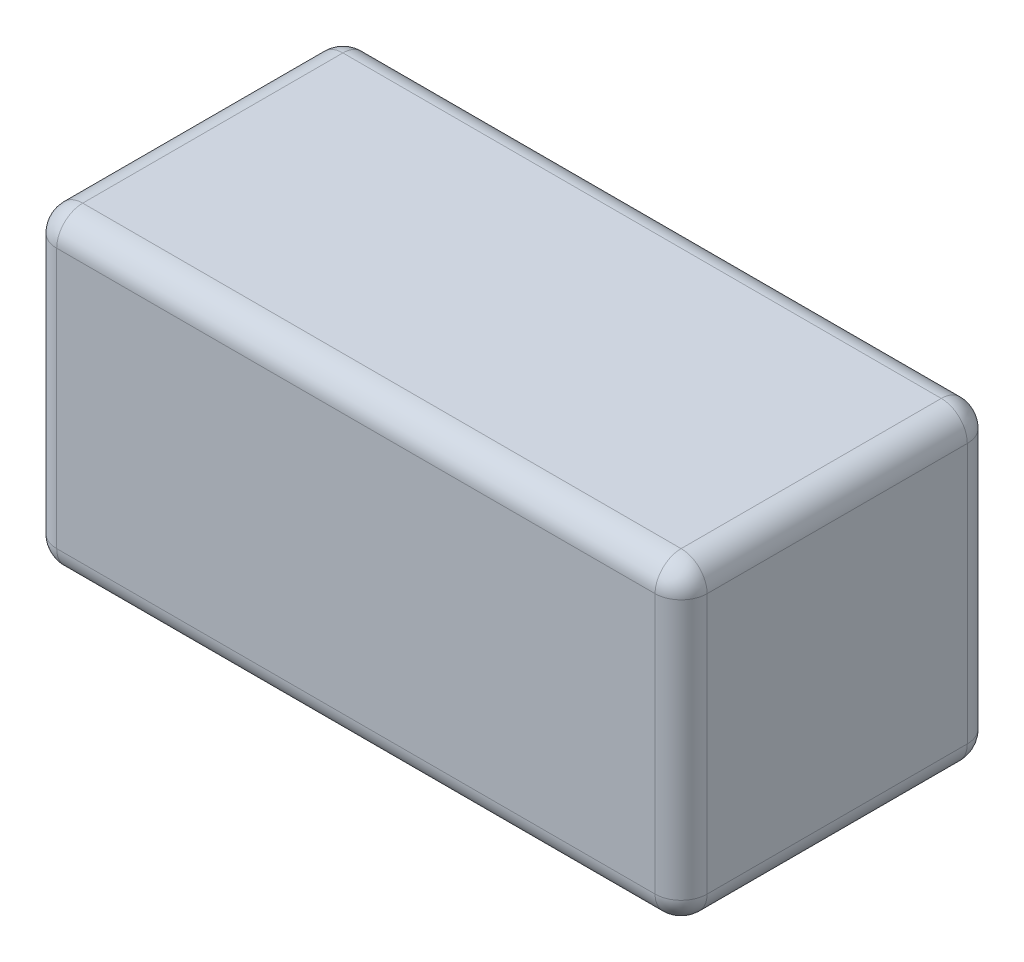
ISO-10303-21;
HEADER;
FILE_DESCRIPTION(('STEP AP214'),'2;1');
FILE_NAME('part.step','',(''),(''),'','','');
FILE_SCHEMA(('AUTOMOTIVE_DESIGN { 1 0 10303 214 1 1 1 1 }'));
ENDSEC;
DATA;
#1=APPLICATION_CONTEXT('core data for automotive mechanical design processes');
#2=APPLICATION_PROTOCOL_DEFINITION('international standard','automotive_design',2000,#1);
#3=PRODUCT_CONTEXT('',#1,'mechanical');
#4=PRODUCT('Part','Part','',(#3));
#5=PRODUCT_RELATED_PRODUCT_CATEGORY('part','',(#4));
#6=PRODUCT_DEFINITION_FORMATION('','',#4);
#7=PRODUCT_DEFINITION_CONTEXT('part definition',#1,'design');
#8=PRODUCT_DEFINITION('design','',#6,#7);
#9=PRODUCT_DEFINITION_SHAPE('','',#8);
#10=(LENGTH_UNIT() NAMED_UNIT(*) SI_UNIT(.MILLI.,.METRE.));
#11=(NAMED_UNIT(*) PLANE_ANGLE_UNIT() SI_UNIT($,.RADIAN.));
#12=(NAMED_UNIT(*) SI_UNIT($,.STERADIAN.) SOLID_ANGLE_UNIT());
#13=UNCERTAINTY_MEASURE_WITH_UNIT(LENGTH_MEASURE(1.E-05),#10,'distance_accuracy_value','');
#14=(GEOMETRIC_REPRESENTATION_CONTEXT(3) GLOBAL_UNCERTAINTY_ASSIGNED_CONTEXT((#13)) GLOBAL_UNIT_ASSIGNED_CONTEXT((#10,
#11,#12)) REPRESENTATION_CONTEXT('',''));
#15=CARTESIAN_POINT('',(0.,0.,0.));
#16=DIRECTION('',(0.,0.,1.));
#17=DIRECTION('',(1.,0.,0.));
#18=AXIS2_PLACEMENT_3D('',#15,#16,#17);
#19=CARTESIAN_POINT('',(25.,24.,-12.));
#20=DIRECTION('',(-1.,0.,0.));
#21=DIRECTION('',(0.,0.,1.));
#22=AXIS2_PLACEMENT_3D('',#19,#20,#21);
#23=PLANE('',#22);
#24=DIRECTION('',(0.,-1.,0.));
#25=VECTOR('',#24,1.);
#26=CARTESIAN_POINT('',(25.,24.,10.));
#27=LINE('',#26,#25);
#28=CARTESIAN_POINT('',(25.,22.,10.));
#29=VERTEX_POINT('',#28);
#30=CARTESIAN_POINT('',(25.,2.,10.));
#31=VERTEX_POINT('',#30);
#32=EDGE_CURVE('E44',#29,#31,#27,.T.);
#33=ORIENTED_EDGE('',*,*,#32,.T.);
#34=DIRECTION('',(0.,0.,-1.));
#35=VECTOR('',#34,1.);
#36=CARTESIAN_POINT('',(25.,2.,-12.));
#37=LINE('',#36,#35);
#38=CARTESIAN_POINT('',(25.,2.,-10.));
#39=VERTEX_POINT('',#38);
#40=EDGE_CURVE('E11',#31,#39,#37,.T.);
#41=ORIENTED_EDGE('',*,*,#40,.T.);
#42=DIRECTION('',(0.,-1.,0.));
#43=VECTOR('',#42,1.);
#44=CARTESIAN_POINT('',(25.,24.,-10.));
#45=LINE('',#44,#43);
#46=CARTESIAN_POINT('',(25.,22.,-10.));
#47=VERTEX_POINT('',#46);
#48=EDGE_CURVE('E202',#39,#47,#45,.F.);
#49=ORIENTED_EDGE('',*,*,#48,.T.);
#50=DIRECTION('',(0.,0.,-1.));
#51=VECTOR('',#50,1.);
#52=CARTESIAN_POINT('',(25.,22.,12.));
#53=LINE('',#52,#51);
#54=EDGE_CURVE('E55',#47,#29,#53,.F.);
#55=ORIENTED_EDGE('',*,*,#54,.T.);
#56=EDGE_LOOP('',(#33,#41,#49,#55));
#57=FACE_BOUND('',#56,.T.);
#58=ADVANCED_FACE('F35',(#57),#23,.F.);
#59=CARTESIAN_POINT('',(-25.,24.,-12.));
#60=DIRECTION('',(0.,0.,1.));
#61=DIRECTION('',(1.,0.,0.));
#62=AXIS2_PLACEMENT_3D('',#59,#60,#61);
#63=PLANE('',#62);
#64=DIRECTION('',(0.,-1.,0.));
#65=VECTOR('',#64,1.);
#66=CARTESIAN_POINT('',(23.,24.,-12.));
#67=LINE('',#66,#65);
#68=CARTESIAN_POINT('',(23.,22.,-12.));
#69=VERTEX_POINT('',#68);
#70=CARTESIAN_POINT('',(23.,2.,-12.));
#71=VERTEX_POINT('',#70);
#72=EDGE_CURVE('E195',#69,#71,#67,.T.);
#73=ORIENTED_EDGE('',*,*,#72,.T.);
#74=DIRECTION('',(-1.,0.,0.));
#75=VECTOR('',#74,1.);
#76=CARTESIAN_POINT('',(-25.,2.,-12.));
#77=LINE('',#76,#75);
#78=CARTESIAN_POINT('',(-23.,2.,-12.));
#79=VERTEX_POINT('',#78);
#80=EDGE_CURVE('E200',#71,#79,#77,.T.);
#81=ORIENTED_EDGE('',*,*,#80,.T.);
#82=DIRECTION('',(0.,-1.,0.));
#83=VECTOR('',#82,1.);
#84=CARTESIAN_POINT('',(-23.,24.,-12.));
#85=LINE('',#84,#83);
#86=CARTESIAN_POINT('',(-23.,22.,-12.));
#87=VERTEX_POINT('',#86);
#88=EDGE_CURVE('E197',#79,#87,#85,.F.);
#89=ORIENTED_EDGE('',*,*,#88,.T.);
#90=DIRECTION('',(-1.,0.,0.));
#91=VECTOR('',#90,1.);
#92=CARTESIAN_POINT('',(25.,22.,-12.));
#93=LINE('',#92,#91);
#94=EDGE_CURVE('E193',#87,#69,#93,.F.);
#95=ORIENTED_EDGE('',*,*,#94,.T.);
#96=EDGE_LOOP('',(#73,#81,#89,#95));
#97=FACE_BOUND('',#96,.T.);
#98=ADVANCED_FACE('F295',(#97),#63,.F.);
#99=CARTESIAN_POINT('',(-25.,24.,-12.));
#100=DIRECTION('',(1.,0.,0.));
#101=DIRECTION('',(0.,0.,-1.));
#102=AXIS2_PLACEMENT_3D('',#99,#100,#101);
#103=PLANE('',#102);
#104=DIRECTION('',(0.,-1.,0.));
#105=VECTOR('',#104,1.);
#106=CARTESIAN_POINT('',(-25.,24.,-10.));
#107=LINE('',#106,#105);
#108=CARTESIAN_POINT('',(-25.,22.,-10.));
#109=VERTEX_POINT('',#108);
#110=CARTESIAN_POINT('',(-25.,2.,-10.));
#111=VERTEX_POINT('',#110);
#112=EDGE_CURVE('E128',#109,#111,#107,.T.);
#113=ORIENTED_EDGE('',*,*,#112,.T.);
#114=DIRECTION('',(0.,0.,1.));
#115=VECTOR('',#114,1.);
#116=CARTESIAN_POINT('',(-25.,2.,-12.));
#117=LINE('',#116,#115);
#118=CARTESIAN_POINT('',(-25.,2.,10.));
#119=VERTEX_POINT('',#118);
#120=EDGE_CURVE('E166',#111,#119,#117,.T.);
#121=ORIENTED_EDGE('',*,*,#120,.T.);
#122=DIRECTION('',(0.,-1.,0.));
#123=VECTOR('',#122,1.);
#124=CARTESIAN_POINT('',(-25.,24.,10.));
#125=LINE('',#124,#123);
#126=CARTESIAN_POINT('',(-25.,22.,10.));
#127=VERTEX_POINT('',#126);
#128=EDGE_CURVE('E131',#119,#127,#125,.F.);
#129=ORIENTED_EDGE('',*,*,#128,.T.);
#130=DIRECTION('',(0.,0.,1.));
#131=VECTOR('',#130,1.);
#132=CARTESIAN_POINT('',(-25.,22.,-12.));
#133=LINE('',#132,#131);
#134=EDGE_CURVE('E123',#127,#109,#133,.F.);
#135=ORIENTED_EDGE('',*,*,#134,.T.);
#136=EDGE_LOOP('',(#113,#121,#129,#135));
#137=FACE_BOUND('',#136,.T.);
#138=ADVANCED_FACE('F125',(#137),#103,.F.);
#139=CARTESIAN_POINT('',(-25.,24.,12.));
#140=DIRECTION('',(0.,0.,-1.));
#141=DIRECTION('',(-1.,0.,0.));
#142=AXIS2_PLACEMENT_3D('',#139,#140,#141);
#143=PLANE('',#142);
#144=DIRECTION('',(0.,-1.,0.));
#145=VECTOR('',#144,1.);
#146=CARTESIAN_POINT('',(-23.,24.,12.));
#147=LINE('',#146,#145);
#148=CARTESIAN_POINT('',(-23.,22.,12.));
#149=VERTEX_POINT('',#148);
#150=CARTESIAN_POINT('',(-23.,2.,12.));
#151=VERTEX_POINT('',#150);
#152=EDGE_CURVE('E181',#149,#151,#147,.T.);
#153=ORIENTED_EDGE('',*,*,#152,.T.);
#154=DIRECTION('',(1.,0.,0.));
#155=VECTOR('',#154,1.);
#156=CARTESIAN_POINT('',(-25.,2.,12.));
#157=LINE('',#156,#155);
#158=CARTESIAN_POINT('',(23.,2.,12.));
#159=VERTEX_POINT('',#158);
#160=EDGE_CURVE('E184',#151,#159,#157,.T.);
#161=ORIENTED_EDGE('',*,*,#160,.T.);
#162=DIRECTION('',(0.,-1.,0.));
#163=VECTOR('',#162,1.);
#164=CARTESIAN_POINT('',(23.,24.,12.));
#165=LINE('',#164,#163);
#166=CARTESIAN_POINT('',(23.,22.,12.));
#167=VERTEX_POINT('',#166);
#168=EDGE_CURVE('E179',#159,#167,#165,.F.);
#169=ORIENTED_EDGE('',*,*,#168,.T.);
#170=DIRECTION('',(1.,0.,0.));
#171=VECTOR('',#170,1.);
#172=CARTESIAN_POINT('',(-25.,22.,12.));
#173=LINE('',#172,#171);
#174=EDGE_CURVE('E177',#167,#149,#173,.F.);
#175=ORIENTED_EDGE('',*,*,#174,.T.);
#176=EDGE_LOOP('',(#153,#161,#169,#175));
#177=FACE_BOUND('',#176,.T.);
#178=ADVANCED_FACE('F266',(#177),#143,.F.);
#179=CARTESIAN_POINT('',(0.,24.,0.));
#180=DIRECTION('',(0.,1.,0.));
#181=DIRECTION('',(0.,0.,1.));
#182=AXIS2_PLACEMENT_3D('',#179,#180,#181);
#183=PLANE('',#182);
#184=DIRECTION('',(0.,0.,-1.));
#185=VECTOR('',#184,1.);
#186=CARTESIAN_POINT('',(23.,24.,-12.));
#187=LINE('',#186,#185);
#188=CARTESIAN_POINT('',(23.,24.,10.));
#189=VERTEX_POINT('',#188);
#190=CARTESIAN_POINT('',(23.,24.,-10.));
#191=VERTEX_POINT('',#190);
#192=EDGE_CURVE('E188',#189,#191,#187,.T.);
#193=ORIENTED_EDGE('',*,*,#192,.T.);
#194=DIRECTION('',(-1.,0.,0.));
#195=VECTOR('',#194,1.);
#196=CARTESIAN_POINT('',(-25.,24.,-10.));
#197=LINE('',#196,#195);
#198=CARTESIAN_POINT('',(-23.,24.,-10.));
#199=VERTEX_POINT('',#198);
#200=EDGE_CURVE('E191',#191,#199,#197,.T.);
#201=ORIENTED_EDGE('',*,*,#200,.T.);
#202=DIRECTION('',(0.,0.,1.));
#203=VECTOR('',#202,1.);
#204=CARTESIAN_POINT('',(-23.,24.,12.));
#205=LINE('',#204,#203);
#206=CARTESIAN_POINT('',(-23.,24.,10.));
#207=VERTEX_POINT('',#206);
#208=EDGE_CURVE('E142',#199,#207,#205,.T.);
#209=ORIENTED_EDGE('',*,*,#208,.T.);
#210=DIRECTION('',(1.,0.,0.));
#211=VECTOR('',#210,1.);
#212=CARTESIAN_POINT('',(25.,24.,10.));
#213=LINE('',#212,#211);
#214=EDGE_CURVE('E186',#207,#189,#213,.T.);
#215=ORIENTED_EDGE('',*,*,#214,.T.);
#216=EDGE_LOOP('',(#193,#201,#209,#215));
#217=FACE_BOUND('',#216,.T.);
#218=ADVANCED_FACE('F300',(#217),#183,.T.);
#219=CARTESIAN_POINT('',(0.,0.,0.));
#220=DIRECTION('',(0.,1.,0.));
#221=DIRECTION('',(0.,0.,1.));
#222=AXIS2_PLACEMENT_3D('',#219,#220,#221);
#223=PLANE('',#222);
#224=DIRECTION('',(0.,0.,1.));
#225=VECTOR('',#224,1.);
#226=CARTESIAN_POINT('',(-23.,0.,0.));
#227=LINE('',#226,#225);
#228=CARTESIAN_POINT('',(-23.,0.,10.));
#229=VERTEX_POINT('',#228);
#230=CARTESIAN_POINT('',(-23.,0.,-10.));
#231=VERTEX_POINT('',#230);
#232=EDGE_CURVE('E172',#229,#231,#227,.F.);
#233=ORIENTED_EDGE('',*,*,#232,.T.);
#234=DIRECTION('',(-1.,0.,0.));
#235=VECTOR('',#234,1.);
#236=CARTESIAN_POINT('',(0.,0.,-10.));
#237=LINE('',#236,#235);
#238=CARTESIAN_POINT('',(23.,0.,-10.));
#239=VERTEX_POINT('',#238);
#240=EDGE_CURVE('E175',#231,#239,#237,.F.);
#241=ORIENTED_EDGE('',*,*,#240,.T.);
#242=DIRECTION('',(0.,0.,-1.));
#243=VECTOR('',#242,1.);
#244=CARTESIAN_POINT('',(23.,0.,0.));
#245=LINE('',#244,#243);
#246=CARTESIAN_POINT('',(23.,0.,10.));
#247=VERTEX_POINT('',#246);
#248=EDGE_CURVE('E170',#239,#247,#245,.F.);
#249=ORIENTED_EDGE('',*,*,#248,.T.);
#250=DIRECTION('',(1.,0.,0.));
#251=VECTOR('',#250,1.);
#252=CARTESIAN_POINT('',(0.,0.,10.));
#253=LINE('',#252,#251);
#254=EDGE_CURVE('E168',#247,#229,#253,.F.);
#255=ORIENTED_EDGE('',*,*,#254,.T.);
#256=EDGE_LOOP('',(#233,#241,#249,#255));
#257=FACE_BOUND('',#256,.T.);
#258=ADVANCED_FACE('F302',(#257),#223,.F.);
#259=CARTESIAN_POINT('',(23.,22.,0.));
#260=DIRECTION('',(0.,0.,1.));
#261=DIRECTION('',(1.,0.,0.));
#262=AXIS2_PLACEMENT_3D('',#259,#260,#261);
#263=CYLINDRICAL_SURFACE('',#262,2.);
#264=CARTESIAN_POINT('',(23.,22.,-10.));
#265=DIRECTION('',(0.,0.,-1.));
#266=DIRECTION('',(-1.,0.,0.));
#267=AXIS2_PLACEMENT_3D('',#264,#265,#266);
#268=CIRCLE('',#267,2.);
#269=EDGE_CURVE('E39',#191,#47,#268,.T.);
#270=ORIENTED_EDGE('',*,*,#269,.F.);
#271=ORIENTED_EDGE('',*,*,#192,.F.);
#272=CARTESIAN_POINT('',(23.,22.,10.));
#273=DIRECTION('',(0.,0.,1.));
#274=DIRECTION('',(1.,0.,0.));
#275=AXIS2_PLACEMENT_3D('',#272,#273,#274);
#276=CIRCLE('',#275,2.);
#277=EDGE_CURVE('E163',#29,#189,#276,.T.);
#278=ORIENTED_EDGE('',*,*,#277,.F.);
#279=ORIENTED_EDGE('',*,*,#54,.F.);
#280=EDGE_LOOP('',(#270,#271,#278,#279));
#281=FACE_BOUND('',#280,.T.);
#282=ADVANCED_FACE('F37',(#281),#263,.T.);
#283=CARTESIAN_POINT('',(23.,22.,-10.));
#284=DIRECTION('',(0.,0.,1.));
#285=DIRECTION('',(1.,0.,0.));
#286=AXIS2_PLACEMENT_3D('',#283,#284,#285);
#287=SPHERICAL_SURFACE('',#286,2.);
#288=CARTESIAN_POINT('',(23.,22.,-10.));
#289=DIRECTION('',(1.,0.,0.));
#290=DIRECTION('',(0.,0.,-1.));
#291=AXIS2_PLACEMENT_3D('',#288,#289,#290);
#292=CIRCLE('',#291,2.);
#293=EDGE_CURVE('E247',#191,#69,#292,.F.);
#294=ORIENTED_EDGE('',*,*,#293,.F.);
#295=ORIENTED_EDGE('',*,*,#269,.T.);
#296=CARTESIAN_POINT('',(23.,22.,-10.));
#297=DIRECTION('',(0.,1.,0.));
#298=DIRECTION('',(0.,0.,1.));
#299=AXIS2_PLACEMENT_3D('',#296,#297,#298);
#300=CIRCLE('',#299,2.);
#301=EDGE_CURVE('E250',#69,#47,#300,.F.);
#302=ORIENTED_EDGE('',*,*,#301,.F.);
#303=EDGE_LOOP('',(#294,#295,#302));
#304=FACE_BOUND('',#303,.T.);
#305=ADVANCED_FACE('F289',(#304),#287,.T.);
#306=CARTESIAN_POINT('',(23.,22.,10.));
#307=DIRECTION('',(0.,0.,1.));
#308=DIRECTION('',(1.,0.,0.));
#309=AXIS2_PLACEMENT_3D('',#306,#307,#308);
#310=SPHERICAL_SURFACE('',#309,2.);
#311=CARTESIAN_POINT('',(23.,22.,10.));
#312=DIRECTION('',(0.,1.,0.));
#313=DIRECTION('',(0.,0.,1.));
#314=AXIS2_PLACEMENT_3D('',#311,#312,#313);
#315=CIRCLE('',#314,2.);
#316=EDGE_CURVE('E241',#29,#167,#315,.F.);
#317=ORIENTED_EDGE('',*,*,#316,.F.);
#318=ORIENTED_EDGE('',*,*,#277,.T.);
#319=CARTESIAN_POINT('',(23.,22.,10.));
#320=DIRECTION('',(1.,0.,0.));
#321=DIRECTION('',(0.,0.,-1.));
#322=AXIS2_PLACEMENT_3D('',#319,#320,#321);
#323=CIRCLE('',#322,2.);
#324=EDGE_CURVE('E244',#167,#189,#323,.F.);
#325=ORIENTED_EDGE('',*,*,#324,.F.);
#326=EDGE_LOOP('',(#317,#318,#325));
#327=FACE_BOUND('',#326,.T.);
#328=ADVANCED_FACE('F256',(#327),#310,.T.);
#329=CARTESIAN_POINT('',(23.,24.,-10.));
#330=DIRECTION('',(0.,-1.,0.));
#331=DIRECTION('',(0.,0.,-1.));
#332=AXIS2_PLACEMENT_3D('',#329,#330,#331);
#333=CYLINDRICAL_SURFACE('',#332,2.);
#334=ORIENTED_EDGE('',*,*,#301,.T.);
#335=ORIENTED_EDGE('',*,*,#48,.F.);
#336=CARTESIAN_POINT('',(23.,2.,-10.));
#337=DIRECTION('',(0.,-1.,0.));
#338=DIRECTION('',(0.,0.,-1.));
#339=AXIS2_PLACEMENT_3D('',#336,#337,#338);
#340=CIRCLE('',#339,2.);
#341=EDGE_CURVE('E236',#71,#39,#340,.T.);
#342=ORIENTED_EDGE('',*,*,#341,.F.);
#343=ORIENTED_EDGE('',*,*,#72,.F.);
#344=EDGE_LOOP('',(#334,#335,#342,#343));
#345=FACE_BOUND('',#344,.T.);
#346=ADVANCED_FACE('F292',(#345),#333,.T.);
#347=CARTESIAN_POINT('',(0.,22.,-10.));
#348=DIRECTION('',(1.,0.,0.));
#349=DIRECTION('',(0.,0.,-1.));
#350=AXIS2_PLACEMENT_3D('',#347,#348,#349);
#351=CYLINDRICAL_SURFACE('',#350,2.);
#352=ORIENTED_EDGE('',*,*,#293,.T.);
#353=ORIENTED_EDGE('',*,*,#94,.F.);
#354=CARTESIAN_POINT('',(-23.,22.,-10.));
#355=DIRECTION('',(-1.,0.,0.));
#356=DIRECTION('',(0.,0.,1.));
#357=AXIS2_PLACEMENT_3D('',#354,#355,#356);
#358=CIRCLE('',#357,2.);
#359=EDGE_CURVE('E146',#199,#87,#358,.T.);
#360=ORIENTED_EDGE('',*,*,#359,.F.);
#361=ORIENTED_EDGE('',*,*,#200,.F.);
#362=EDGE_LOOP('',(#352,#353,#360,#361));
#363=FACE_BOUND('',#362,.T.);
#364=ADVANCED_FACE('F298',(#363),#351,.T.);
#365=CARTESIAN_POINT('',(-23.,22.,0.));
#366=DIRECTION('',(0.,0.,-1.));
#367=DIRECTION('',(-1.,0.,0.));
#368=AXIS2_PLACEMENT_3D('',#365,#366,#367);
#369=CYLINDRICAL_SURFACE('',#368,2.);
#370=CARTESIAN_POINT('',(-23.,22.,10.));
#371=DIRECTION('',(0.,0.,1.));
#372=DIRECTION('',(1.,0.,0.));
#373=AXIS2_PLACEMENT_3D('',#370,#371,#372);
#374=CIRCLE('',#373,2.);
#375=EDGE_CURVE('E147',#207,#127,#374,.T.);
#376=ORIENTED_EDGE('',*,*,#375,.F.);
#377=ORIENTED_EDGE('',*,*,#208,.F.);
#378=CARTESIAN_POINT('',(-23.,22.,-10.));
#379=DIRECTION('',(0.,0.,-1.));
#380=DIRECTION('',(-1.,0.,0.));
#381=AXIS2_PLACEMENT_3D('',#378,#379,#380);
#382=CIRCLE('',#381,2.);
#383=EDGE_CURVE('E138',#109,#199,#382,.T.);
#384=ORIENTED_EDGE('',*,*,#383,.F.);
#385=ORIENTED_EDGE('',*,*,#134,.F.);
#386=EDGE_LOOP('',(#376,#377,#384,#385));
#387=FACE_BOUND('',#386,.T.);
#388=ADVANCED_FACE('F140',(#387),#369,.T.);
#389=CARTESIAN_POINT('',(0.,22.,10.));
#390=DIRECTION('',(-1.,0.,0.));
#391=DIRECTION('',(0.,0.,1.));
#392=AXIS2_PLACEMENT_3D('',#389,#390,#391);
#393=CYLINDRICAL_SURFACE('',#392,2.);
#394=ORIENTED_EDGE('',*,*,#324,.T.);
#395=ORIENTED_EDGE('',*,*,#214,.F.);
#396=CARTESIAN_POINT('',(-23.,22.,10.));
#397=DIRECTION('',(-1.,0.,0.));
#398=DIRECTION('',(0.,-1.,0.));
#399=AXIS2_PLACEMENT_3D('',#396,#397,#398);
#400=CIRCLE('',#399,2.);
#401=EDGE_CURVE('E232',#149,#207,#400,.T.);
#402=ORIENTED_EDGE('',*,*,#401,.F.);
#403=ORIENTED_EDGE('',*,*,#174,.F.);
#404=EDGE_LOOP('',(#394,#395,#402,#403));
#405=FACE_BOUND('',#404,.T.);
#406=ADVANCED_FACE('F262',(#405),#393,.T.);
#407=CARTESIAN_POINT('',(23.,24.,10.));
#408=DIRECTION('',(0.,-1.,0.));
#409=DIRECTION('',(0.,0.,-1.));
#410=AXIS2_PLACEMENT_3D('',#407,#408,#409);
#411=CYLINDRICAL_SURFACE('',#410,2.);
#412=ORIENTED_EDGE('',*,*,#316,.T.);
#413=ORIENTED_EDGE('',*,*,#168,.F.);
#414=CARTESIAN_POINT('',(23.,2.,10.));
#415=DIRECTION('',(0.,-1.,0.));
#416=DIRECTION('',(0.,0.,-1.));
#417=AXIS2_PLACEMENT_3D('',#414,#415,#416);
#418=CIRCLE('',#417,2.);
#419=EDGE_CURVE('E229',#31,#159,#418,.T.);
#420=ORIENTED_EDGE('',*,*,#419,.F.);
#421=ORIENTED_EDGE('',*,*,#32,.F.);
#422=EDGE_LOOP('',(#412,#413,#420,#421));
#423=FACE_BOUND('',#422,.T.);
#424=ADVANCED_FACE('F272',(#423),#411,.T.);
#425=CARTESIAN_POINT('',(23.,2.,-12.));
#426=DIRECTION('',(0.,0.,-1.));
#427=DIRECTION('',(-1.,0.,0.));
#428=AXIS2_PLACEMENT_3D('',#425,#426,#427);
#429=CYLINDRICAL_SURFACE('',#428,2.);
#430=CARTESIAN_POINT('',(23.,2.,-10.));
#431=DIRECTION('',(0.,0.,-1.));
#432=DIRECTION('',(-1.,0.,0.));
#433=AXIS2_PLACEMENT_3D('',#430,#431,#432);
#434=CIRCLE('',#433,2.);
#435=EDGE_CURVE('E238',#39,#239,#434,.T.);
#436=ORIENTED_EDGE('',*,*,#435,.F.);
#437=ORIENTED_EDGE('',*,*,#40,.F.);
#438=CARTESIAN_POINT('',(23.,2.,10.));
#439=DIRECTION('',(0.,0.,1.));
#440=DIRECTION('',(1.,0.,0.));
#441=AXIS2_PLACEMENT_3D('',#438,#439,#440);
#442=CIRCLE('',#441,2.);
#443=EDGE_CURVE('E226',#247,#31,#442,.T.);
#444=ORIENTED_EDGE('',*,*,#443,.F.);
#445=ORIENTED_EDGE('',*,*,#248,.F.);
#446=EDGE_LOOP('',(#436,#437,#444,#445));
#447=FACE_BOUND('',#446,.T.);
#448=ADVANCED_FACE('F281',(#447),#429,.T.);
#449=CARTESIAN_POINT('',(23.,2.,-10.));
#450=DIRECTION('',(0.,0.,1.));
#451=DIRECTION('',(1.,0.,0.));
#452=AXIS2_PLACEMENT_3D('',#449,#450,#451);
#453=SPHERICAL_SURFACE('',#452,2.);
#454=ORIENTED_EDGE('',*,*,#341,.T.);
#455=ORIENTED_EDGE('',*,*,#435,.T.);
#456=CARTESIAN_POINT('',(23.,2.,-10.));
#457=DIRECTION('',(1.,0.,0.));
#458=DIRECTION('',(0.,0.,-1.));
#459=AXIS2_PLACEMENT_3D('',#456,#457,#458);
#460=CIRCLE('',#459,2.);
#461=EDGE_CURVE('E154',#71,#239,#460,.F.);
#462=ORIENTED_EDGE('',*,*,#461,.F.);
#463=EDGE_LOOP('',(#454,#455,#462));
#464=FACE_BOUND('',#463,.T.);
#465=ADVANCED_FACE('F353',(#464),#453,.T.);
#466=CARTESIAN_POINT('',(-23.,22.,-10.));
#467=DIRECTION('',(0.,0.,1.));
#468=DIRECTION('',(1.,0.,0.));
#469=AXIS2_PLACEMENT_3D('',#466,#467,#468);
#470=SPHERICAL_SURFACE('',#469,2.);
#471=ORIENTED_EDGE('',*,*,#383,.T.);
#472=ORIENTED_EDGE('',*,*,#359,.T.);
#473=CARTESIAN_POINT('',(-23.,22.,-10.));
#474=DIRECTION('',(0.,1.,0.));
#475=DIRECTION('',(0.,0.,1.));
#476=AXIS2_PLACEMENT_3D('',#473,#474,#475);
#477=CIRCLE('',#476,2.);
#478=EDGE_CURVE('E149',#109,#87,#477,.F.);
#479=ORIENTED_EDGE('',*,*,#478,.F.);
#480=EDGE_LOOP('',(#471,#472,#479));
#481=FACE_BOUND('',#480,.T.);
#482=ADVANCED_FACE('F150',(#481),#470,.T.);
#483=CARTESIAN_POINT('',(-23.,22.,10.));
#484=DIRECTION('',(0.,0.,1.));
#485=DIRECTION('',(1.,0.,0.));
#486=AXIS2_PLACEMENT_3D('',#483,#484,#485);
#487=SPHERICAL_SURFACE('',#486,2.);
#488=ORIENTED_EDGE('',*,*,#401,.T.);
#489=ORIENTED_EDGE('',*,*,#375,.T.);
#490=CARTESIAN_POINT('',(-23.,22.,10.));
#491=DIRECTION('',(0.,1.,0.));
#492=DIRECTION('',(0.,0.,1.));
#493=AXIS2_PLACEMENT_3D('',#490,#491,#492);
#494=CIRCLE('',#493,2.);
#495=EDGE_CURVE('E155',#149,#127,#494,.F.);
#496=ORIENTED_EDGE('',*,*,#495,.F.);
#497=EDGE_LOOP('',(#488,#489,#496));
#498=FACE_BOUND('',#497,.T.);
#499=ADVANCED_FACE('F347',(#498),#487,.T.);
#500=CARTESIAN_POINT('',(23.,2.,10.));
#501=DIRECTION('',(0.,0.,1.));
#502=DIRECTION('',(1.,0.,0.));
#503=AXIS2_PLACEMENT_3D('',#500,#501,#502);
#504=SPHERICAL_SURFACE('',#503,2.);
#505=ORIENTED_EDGE('',*,*,#443,.T.);
#506=ORIENTED_EDGE('',*,*,#419,.T.);
#507=CARTESIAN_POINT('',(23.,2.,10.));
#508=DIRECTION('',(1.,0.,0.));
#509=DIRECTION('',(0.,0.,-1.));
#510=AXIS2_PLACEMENT_3D('',#507,#508,#509);
#511=CIRCLE('',#510,2.);
#512=EDGE_CURVE('E219',#247,#159,#511,.F.);
#513=ORIENTED_EDGE('',*,*,#512,.F.);
#514=EDGE_LOOP('',(#505,#506,#513));
#515=FACE_BOUND('',#514,.T.);
#516=ADVANCED_FACE('F276',(#515),#504,.T.);
#517=CARTESIAN_POINT('',(-25.,2.,-10.));
#518=DIRECTION('',(-1.,0.,0.));
#519=DIRECTION('',(0.,0.,1.));
#520=AXIS2_PLACEMENT_3D('',#517,#518,#519);
#521=CYLINDRICAL_SURFACE('',#520,2.);
#522=ORIENTED_EDGE('',*,*,#461,.T.);
#523=ORIENTED_EDGE('',*,*,#240,.F.);
#524=CARTESIAN_POINT('',(-23.,2.,-10.));
#525=DIRECTION('',(-1.,0.,0.));
#526=DIRECTION('',(0.,0.,1.));
#527=AXIS2_PLACEMENT_3D('',#524,#525,#526);
#528=CIRCLE('',#527,2.);
#529=EDGE_CURVE('E216',#79,#231,#528,.T.);
#530=ORIENTED_EDGE('',*,*,#529,.F.);
#531=ORIENTED_EDGE('',*,*,#80,.F.);
#532=EDGE_LOOP('',(#522,#523,#530,#531));
#533=FACE_BOUND('',#532,.T.);
#534=ADVANCED_FACE('F341',(#533),#521,.T.);
#535=CARTESIAN_POINT('',(-23.,24.,-10.));
#536=DIRECTION('',(0.,-1.,0.));
#537=DIRECTION('',(0.,0.,-1.));
#538=AXIS2_PLACEMENT_3D('',#535,#536,#537);
#539=CYLINDRICAL_SURFACE('',#538,2.);
#540=ORIENTED_EDGE('',*,*,#478,.T.);
#541=ORIENTED_EDGE('',*,*,#88,.F.);
#542=CARTESIAN_POINT('',(-23.,2.,-10.));
#543=DIRECTION('',(0.,-1.,0.));
#544=DIRECTION('',(0.,0.,-1.));
#545=AXIS2_PLACEMENT_3D('',#542,#543,#544);
#546=CIRCLE('',#545,2.);
#547=EDGE_CURVE('E159',#111,#79,#546,.T.);
#548=ORIENTED_EDGE('',*,*,#547,.F.);
#549=ORIENTED_EDGE('',*,*,#112,.F.);
#550=EDGE_LOOP('',(#540,#541,#548,#549));
#551=FACE_BOUND('',#550,.T.);
#552=ADVANCED_FACE('F157',(#551),#539,.T.);
#553=CARTESIAN_POINT('',(-23.,24.,10.));
#554=DIRECTION('',(0.,-1.,0.));
#555=DIRECTION('',(0.,0.,-1.));
#556=AXIS2_PLACEMENT_3D('',#553,#554,#555);
#557=CYLINDRICAL_SURFACE('',#556,2.);
#558=ORIENTED_EDGE('',*,*,#495,.T.);
#559=ORIENTED_EDGE('',*,*,#128,.F.);
#560=CARTESIAN_POINT('',(-23.,2.,10.));
#561=DIRECTION('',(0.,-1.,0.));
#562=DIRECTION('',(0.,0.,-1.));
#563=AXIS2_PLACEMENT_3D('',#560,#561,#562);
#564=CIRCLE('',#563,2.);
#565=EDGE_CURVE('E212',#151,#119,#564,.T.);
#566=ORIENTED_EDGE('',*,*,#565,.F.);
#567=ORIENTED_EDGE('',*,*,#152,.F.);
#568=EDGE_LOOP('',(#558,#559,#566,#567));
#569=FACE_BOUND('',#568,.T.);
#570=ADVANCED_FACE('F334',(#569),#557,.T.);
#571=CARTESIAN_POINT('',(-25.,2.,10.));
#572=DIRECTION('',(1.,0.,0.));
#573=DIRECTION('',(0.,0.,-1.));
#574=AXIS2_PLACEMENT_3D('',#571,#572,#573);
#575=CYLINDRICAL_SURFACE('',#574,2.);
#576=ORIENTED_EDGE('',*,*,#512,.T.);
#577=ORIENTED_EDGE('',*,*,#160,.F.);
#578=CARTESIAN_POINT('',(-23.,2.,10.));
#579=DIRECTION('',(-1.,0.,0.));
#580=DIRECTION('',(0.,0.,1.));
#581=AXIS2_PLACEMENT_3D('',#578,#579,#580);
#582=CIRCLE('',#581,2.);
#583=EDGE_CURVE('E210',#229,#151,#582,.T.);
#584=ORIENTED_EDGE('',*,*,#583,.F.);
#585=ORIENTED_EDGE('',*,*,#254,.F.);
#586=EDGE_LOOP('',(#576,#577,#584,#585));
#587=FACE_BOUND('',#586,.T.);
#588=ADVANCED_FACE('F330',(#587),#575,.T.);
#589=CARTESIAN_POINT('',(-23.,2.,-10.));
#590=DIRECTION('',(0.,0.,1.));
#591=DIRECTION('',(1.,0.,0.));
#592=AXIS2_PLACEMENT_3D('',#589,#590,#591);
#593=SPHERICAL_SURFACE('',#592,2.);
#594=ORIENTED_EDGE('',*,*,#547,.T.);
#595=ORIENTED_EDGE('',*,*,#529,.T.);
#596=CARTESIAN_POINT('',(-23.,2.,-10.));
#597=DIRECTION('',(0.,0.,-1.));
#598=DIRECTION('',(-1.,0.,0.));
#599=AXIS2_PLACEMENT_3D('',#596,#597,#598);
#600=CIRCLE('',#599,2.);
#601=EDGE_CURVE('E208',#111,#231,#600,.F.);
#602=ORIENTED_EDGE('',*,*,#601,.F.);
#603=EDGE_LOOP('',(#594,#595,#602));
#604=FACE_BOUND('',#603,.T.);
#605=ADVANCED_FACE('F326',(#604),#593,.T.);
#606=CARTESIAN_POINT('',(-23.,2.,10.));
#607=DIRECTION('',(0.,0.,1.));
#608=DIRECTION('',(1.,0.,0.));
#609=AXIS2_PLACEMENT_3D('',#606,#607,#608);
#610=SPHERICAL_SURFACE('',#609,2.);
#611=ORIENTED_EDGE('',*,*,#583,.T.);
#612=ORIENTED_EDGE('',*,*,#565,.T.);
#613=CARTESIAN_POINT('',(-23.,2.,10.));
#614=DIRECTION('',(0.,0.,1.));
#615=DIRECTION('',(1.,0.,0.));
#616=AXIS2_PLACEMENT_3D('',#613,#614,#615);
#617=CIRCLE('',#616,2.);
#618=EDGE_CURVE('E206',#229,#119,#617,.F.);
#619=ORIENTED_EDGE('',*,*,#618,.F.);
#620=EDGE_LOOP('',(#611,#612,#619));
#621=FACE_BOUND('',#620,.T.);
#622=ADVANCED_FACE('F322',(#621),#610,.T.);
#623=CARTESIAN_POINT('',(-23.,2.,-12.));
#624=DIRECTION('',(0.,0.,1.));
#625=DIRECTION('',(1.,0.,0.));
#626=AXIS2_PLACEMENT_3D('',#623,#624,#625);
#627=CYLINDRICAL_SURFACE('',#626,2.);
#628=ORIENTED_EDGE('',*,*,#601,.T.);
#629=ORIENTED_EDGE('',*,*,#232,.F.);
#630=ORIENTED_EDGE('',*,*,#618,.T.);
#631=ORIENTED_EDGE('',*,*,#120,.F.);
#632=EDGE_LOOP('',(#628,#629,#630,#631));
#633=FACE_BOUND('',#632,.T.);
#634=ADVANCED_FACE('F319',(#633),#627,.T.);
#635=CLOSED_SHELL('',(#58,#98,#138,#178,#218,#258,#282,#305,#328,#346,#364,#388,#406,#424,#448,
#465,#482,#499,#516,#534,#552,#570,#588,#605,#622,#634));
#636=MANIFOLD_SOLID_BREP('B2',#635);
#637=ADVANCED_BREP_SHAPE_REPRESENTATION('',(#18,#636),#14);
#638=SHAPE_DEFINITION_REPRESENTATION(#9,#637);
ENDSEC;
END-ISO-10303-21;
